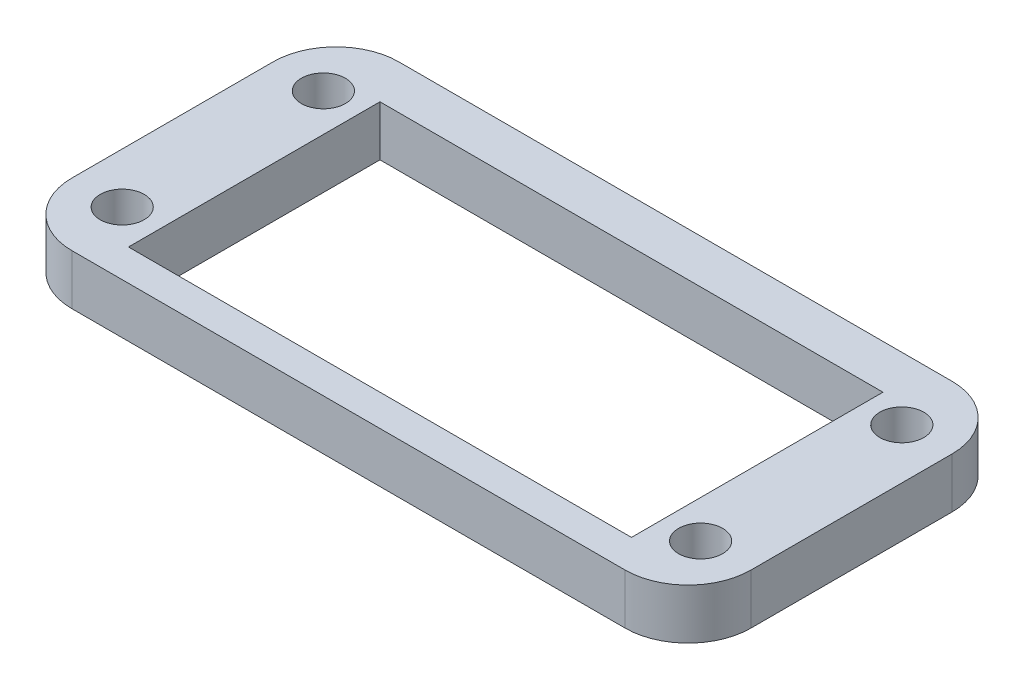
ISO-10303-21;
HEADER;
FILE_DESCRIPTION(('STEP AP214'),'2;1');
FILE_NAME('part.step','',(''),(''),'','','');
FILE_SCHEMA(('AUTOMOTIVE_DESIGN { 1 0 10303 214 1 1 1 1 }'));
ENDSEC;
DATA;
#1=APPLICATION_CONTEXT('core data for automotive mechanical design processes');
#2=APPLICATION_PROTOCOL_DEFINITION('international standard','automotive_design',2000,#1);
#3=PRODUCT_CONTEXT('',#1,'mechanical');
#4=PRODUCT('Part','Part','',(#3));
#5=PRODUCT_RELATED_PRODUCT_CATEGORY('part','',(#4));
#6=PRODUCT_DEFINITION_FORMATION('','',#4);
#7=PRODUCT_DEFINITION_CONTEXT('part definition',#1,'design');
#8=PRODUCT_DEFINITION('design','',#6,#7);
#9=PRODUCT_DEFINITION_SHAPE('','',#8);
#10=(LENGTH_UNIT() NAMED_UNIT(*) SI_UNIT(.MILLI.,.METRE.));
#11=(NAMED_UNIT(*) PLANE_ANGLE_UNIT() SI_UNIT($,.RADIAN.));
#12=(NAMED_UNIT(*) SI_UNIT($,.STERADIAN.) SOLID_ANGLE_UNIT());
#13=UNCERTAINTY_MEASURE_WITH_UNIT(LENGTH_MEASURE(1.E-05),#10,'distance_accuracy_value','');
#14=(GEOMETRIC_REPRESENTATION_CONTEXT(3) GLOBAL_UNCERTAINTY_ASSIGNED_CONTEXT((#13)) GLOBAL_UNIT_ASSIGNED_CONTEXT((#10,
#11,#12)) REPRESENTATION_CONTEXT('',''));
#15=CARTESIAN_POINT('',(0.,0.,0.));
#16=DIRECTION('',(0.,0.,1.));
#17=DIRECTION('',(1.,0.,0.));
#18=AXIS2_PLACEMENT_3D('',#15,#16,#17);
#19=CARTESIAN_POINT('',(22.,4.,-8.));
#20=DIRECTION('',(0.,-1.,0.));
#21=DIRECTION('',(0.,0.,-1.));
#22=AXIS2_PLACEMENT_3D('',#19,#20,#21);
#23=PLANE('',#22);
#24=CARTESIAN_POINT('',(22.,4.,-8.));
#25=DIRECTION('',(0.,1.,0.));
#26=DIRECTION('',(0.,0.,-1.));
#27=AXIS2_PLACEMENT_3D('',#24,#25,#26);
#28=CIRCLE('',#27,5.);
#29=CARTESIAN_POINT('',(27.,4.,-7.99999999999997));
#30=VERTEX_POINT('',#29);
#31=CARTESIAN_POINT('',(22.,4.,-13.));
#32=VERTEX_POINT('',#31);
#33=EDGE_CURVE('E182',#30,#32,#28,.T.);
#34=ORIENTED_EDGE('',*,*,#33,.T.);
#35=DIRECTION('',(-1.,0.,0.));
#36=VECTOR('',#35,1.);
#37=CARTESIAN_POINT('',(-22.,4.,-13.));
#38=LINE('',#37,#36);
#39=CARTESIAN_POINT('',(-22.,4.,-13.));
#40=VERTEX_POINT('',#39);
#41=EDGE_CURVE('E186',#32,#40,#38,.T.);
#42=ORIENTED_EDGE('',*,*,#41,.T.);
#43=CARTESIAN_POINT('',(-22.,4.,-8.));
#44=DIRECTION('',(0.,1.,0.));
#45=DIRECTION('',(0.,0.,1.));
#46=AXIS2_PLACEMENT_3D('',#43,#44,#45);
#47=CIRCLE('',#46,5.);
#48=CARTESIAN_POINT('',(-27.,4.,-7.99999999999997));
#49=VERTEX_POINT('',#48);
#50=EDGE_CURVE('E190',#40,#49,#47,.T.);
#51=ORIENTED_EDGE('',*,*,#50,.T.);
#52=DIRECTION('',(0.,0.,1.));
#53=VECTOR('',#52,1.);
#54=CARTESIAN_POINT('',(-27.,4.,-7.99999999999996));
#55=LINE('',#54,#53);
#56=CARTESIAN_POINT('',(-27.,4.,7.99999999999997));
#57=VERTEX_POINT('',#56);
#58=EDGE_CURVE('E193',#49,#57,#55,.T.);
#59=ORIENTED_EDGE('',*,*,#58,.T.);
#60=CARTESIAN_POINT('',(-22.,4.,8.));
#61=DIRECTION('',(0.,1.,0.));
#62=DIRECTION('',(0.,0.,1.));
#63=AXIS2_PLACEMENT_3D('',#60,#61,#62);
#64=CIRCLE('',#63,5.);
#65=CARTESIAN_POINT('',(-22.,4.,13.));
#66=VERTEX_POINT('',#65);
#67=EDGE_CURVE('E196',#57,#66,#64,.T.);
#68=ORIENTED_EDGE('',*,*,#67,.T.);
#69=DIRECTION('',(1.,0.,0.));
#70=VECTOR('',#69,1.);
#71=CARTESIAN_POINT('',(-22.,4.,13.));
#72=LINE('',#71,#70);
#73=CARTESIAN_POINT('',(22.,4.,13.));
#74=VERTEX_POINT('',#73);
#75=EDGE_CURVE('E199',#66,#74,#72,.T.);
#76=ORIENTED_EDGE('',*,*,#75,.T.);
#77=CARTESIAN_POINT('',(22.,4.,8.));
#78=DIRECTION('',(0.,1.,0.));
#79=DIRECTION('',(0.,0.,-1.));
#80=AXIS2_PLACEMENT_3D('',#77,#78,#79);
#81=CIRCLE('',#80,5.);
#82=CARTESIAN_POINT('',(27.,4.,7.99999999999996));
#83=VERTEX_POINT('',#82);
#84=EDGE_CURVE('E202',#74,#83,#81,.T.);
#85=ORIENTED_EDGE('',*,*,#84,.T.);
#86=DIRECTION('',(0.,0.,-1.));
#87=VECTOR('',#86,1.);
#88=CARTESIAN_POINT('',(27.,4.,-7.99999999999997));
#89=LINE('',#88,#87);
#90=EDGE_CURVE('E205',#83,#30,#89,.T.);
#91=ORIENTED_EDGE('',*,*,#90,.T.);
#92=EDGE_LOOP('',(#34,#42,#51,#59,#68,#76,#85,#91));
#93=FACE_BOUND('',#92,.T.);
#94=DIRECTION('',(0.,0.,1.));
#95=VECTOR('',#94,1.);
#96=CARTESIAN_POINT('',(-20.,4.,-9.5));
#97=LINE('',#96,#95);
#98=CARTESIAN_POINT('',(-20.,4.,-9.5));
#99=VERTEX_POINT('',#98);
#100=CARTESIAN_POINT('',(-20.,4.,10.5));
#101=VERTEX_POINT('',#100);
#102=EDGE_CURVE('E130',#99,#101,#97,.T.);
#103=ORIENTED_EDGE('',*,*,#102,.F.);
#104=DIRECTION('',(-1.,0.,0.));
#105=VECTOR('',#104,1.);
#106=CARTESIAN_POINT('',(-20.,4.,-9.5));
#107=LINE('',#106,#105);
#108=CARTESIAN_POINT('',(20.,4.,-9.5));
#109=VERTEX_POINT('',#108);
#110=EDGE_CURVE('E159',#109,#99,#107,.T.);
#111=ORIENTED_EDGE('',*,*,#110,.F.);
#112=DIRECTION('',(0.,0.,-1.));
#113=VECTOR('',#112,1.);
#114=CARTESIAN_POINT('',(20.,4.,-9.5));
#115=LINE('',#114,#113);
#116=CARTESIAN_POINT('',(20.,4.,10.5));
#117=VERTEX_POINT('',#116);
#118=EDGE_CURVE('E153',#117,#109,#115,.T.);
#119=ORIENTED_EDGE('',*,*,#118,.F.);
#120=DIRECTION('',(1.,0.,0.));
#121=VECTOR('',#120,1.);
#122=CARTESIAN_POINT('',(-20.,4.,10.5));
#123=LINE('',#122,#121);
#124=EDGE_CURVE('E139',#101,#117,#123,.T.);
#125=ORIENTED_EDGE('',*,*,#124,.F.);
#126=EDGE_LOOP('',(#103,#111,#119,#125));
#127=FACE_BOUND('',#126,.T.);
#128=CARTESIAN_POINT('',(-23.,4.,8.));
#129=DIRECTION('',(0.,1.,0.));
#130=DIRECTION('',(0.,0.,1.));
#131=AXIS2_PLACEMENT_3D('',#128,#129,#130);
#132=CIRCLE('',#131,1.75);
#133=CARTESIAN_POINT('',(-23.,4.,9.75));
#134=VERTEX_POINT('',#133);
#135=EDGE_CURVE('E167',#134,#134,#132,.T.);
#136=ORIENTED_EDGE('',*,*,#135,.F.);
#137=EDGE_LOOP('',(#136));
#138=FACE_BOUND('',#137,.T.);
#139=CARTESIAN_POINT('',(-23.,4.,-8.));
#140=DIRECTION('',(0.,1.,0.));
#141=DIRECTION('',(0.,0.,1.));
#142=AXIS2_PLACEMENT_3D('',#139,#140,#141);
#143=CIRCLE('',#142,1.75);
#144=CARTESIAN_POINT('',(-23.,4.,-6.25));
#145=VERTEX_POINT('',#144);
#146=EDGE_CURVE('E372',#145,#145,#143,.T.);
#147=ORIENTED_EDGE('',*,*,#146,.F.);
#148=EDGE_LOOP('',(#147));
#149=FACE_BOUND('',#148,.T.);
#150=CARTESIAN_POINT('',(23.,4.,-8.));
#151=DIRECTION('',(0.,1.,0.));
#152=DIRECTION('',(0.,0.,1.));
#153=AXIS2_PLACEMENT_3D('',#150,#151,#152);
#154=CIRCLE('',#153,1.75);
#155=CARTESIAN_POINT('',(23.,4.,-6.25));
#156=VERTEX_POINT('',#155);
#157=EDGE_CURVE('E364',#156,#156,#154,.T.);
#158=ORIENTED_EDGE('',*,*,#157,.F.);
#159=EDGE_LOOP('',(#158));
#160=FACE_BOUND('',#159,.T.);
#161=CARTESIAN_POINT('',(23.,4.,8.));
#162=DIRECTION('',(0.,1.,0.));
#163=DIRECTION('',(0.,0.,1.));
#164=AXIS2_PLACEMENT_3D('',#161,#162,#163);
#165=CIRCLE('',#164,1.75);
#166=CARTESIAN_POINT('',(23.,4.,9.75));
#167=VERTEX_POINT('',#166);
#168=EDGE_CURVE('E352',#167,#167,#165,.T.);
#169=ORIENTED_EDGE('',*,*,#168,.F.);
#170=EDGE_LOOP('',(#169));
#171=FACE_BOUND('',#170,.T.);
#172=ADVANCED_FACE('F40',(#93,#127,#138,#149,#160,#171),#23,.F.);
#173=CARTESIAN_POINT('',(22.,0.,-8.));
#174=DIRECTION('',(0.,-1.,0.));
#175=DIRECTION('',(0.,0.,-1.));
#176=AXIS2_PLACEMENT_3D('',#173,#174,#175);
#177=PLANE('',#176);
#178=CARTESIAN_POINT('',(23.,0.,-8.));
#179=DIRECTION('',(0.,1.,0.));
#180=DIRECTION('',(0.,0.,1.));
#181=AXIS2_PLACEMENT_3D('',#178,#179,#180);
#182=CIRCLE('',#181,1.75);
#183=CARTESIAN_POINT('',(23.,0.,-6.25));
#184=VERTEX_POINT('',#183);
#185=EDGE_CURVE('E361',#184,#184,#182,.T.);
#186=ORIENTED_EDGE('',*,*,#185,.T.);
#187=EDGE_LOOP('',(#186));
#188=FACE_BOUND('',#187,.T.);
#189=CARTESIAN_POINT('',(-23.,0.,8.));
#190=DIRECTION('',(0.,1.,0.));
#191=DIRECTION('',(0.,0.,1.));
#192=AXIS2_PLACEMENT_3D('',#189,#190,#191);
#193=CIRCLE('',#192,1.75);
#194=CARTESIAN_POINT('',(-23.,0.,9.75));
#195=VERTEX_POINT('',#194);
#196=EDGE_CURVE('E376',#195,#195,#193,.T.);
#197=ORIENTED_EDGE('',*,*,#196,.T.);
#198=EDGE_LOOP('',(#197));
#199=FACE_BOUND('',#198,.T.);
#200=CARTESIAN_POINT('',(22.,0.,-8.));
#201=DIRECTION('',(0.,1.,0.));
#202=DIRECTION('',(0.,0.,-1.));
#203=AXIS2_PLACEMENT_3D('',#200,#201,#202);
#204=CIRCLE('',#203,5.);
#205=CARTESIAN_POINT('',(27.,0.,-7.99999999999997));
#206=VERTEX_POINT('',#205);
#207=CARTESIAN_POINT('',(22.,0.,-13.));
#208=VERTEX_POINT('',#207);
#209=EDGE_CURVE('E148',#206,#208,#204,.T.);
#210=ORIENTED_EDGE('',*,*,#209,.F.);
#211=DIRECTION('',(0.,0.,-1.));
#212=VECTOR('',#211,1.);
#213=CARTESIAN_POINT('',(27.,0.,-7.99999999999997));
#214=LINE('',#213,#212);
#215=CARTESIAN_POINT('',(27.,0.,7.99999999999996));
#216=VERTEX_POINT('',#215);
#217=EDGE_CURVE('E187',#216,#206,#214,.T.);
#218=ORIENTED_EDGE('',*,*,#217,.F.);
#219=CARTESIAN_POINT('',(22.,0.,8.));
#220=DIRECTION('',(0.,1.,0.));
#221=DIRECTION('',(0.,0.,-1.));
#222=AXIS2_PLACEMENT_3D('',#219,#220,#221);
#223=CIRCLE('',#222,5.);
#224=CARTESIAN_POINT('',(22.,0.,13.));
#225=VERTEX_POINT('',#224);
#226=EDGE_CURVE('E227',#225,#216,#223,.T.);
#227=ORIENTED_EDGE('',*,*,#226,.F.);
#228=DIRECTION('',(1.,0.,0.));
#229=VECTOR('',#228,1.);
#230=CARTESIAN_POINT('',(-22.,0.,13.));
#231=LINE('',#230,#229);
#232=CARTESIAN_POINT('',(-22.,0.,13.));
#233=VERTEX_POINT('',#232);
#234=EDGE_CURVE('E224',#233,#225,#231,.T.);
#235=ORIENTED_EDGE('',*,*,#234,.F.);
#236=CARTESIAN_POINT('',(-22.,0.,8.));
#237=DIRECTION('',(0.,1.,0.));
#238=DIRECTION('',(0.,0.,1.));
#239=AXIS2_PLACEMENT_3D('',#236,#237,#238);
#240=CIRCLE('',#239,5.);
#241=CARTESIAN_POINT('',(-27.,0.,7.99999999999997));
#242=VERTEX_POINT('',#241);
#243=EDGE_CURVE('E221',#242,#233,#240,.T.);
#244=ORIENTED_EDGE('',*,*,#243,.F.);
#245=DIRECTION('',(0.,0.,1.));
#246=VECTOR('',#245,1.);
#247=CARTESIAN_POINT('',(-27.,0.,-7.99999999999996));
#248=LINE('',#247,#246);
#249=CARTESIAN_POINT('',(-27.,0.,-7.99999999999997));
#250=VERTEX_POINT('',#249);
#251=EDGE_CURVE('E218',#250,#242,#248,.T.);
#252=ORIENTED_EDGE('',*,*,#251,.F.);
#253=CARTESIAN_POINT('',(-22.,0.,-8.));
#254=DIRECTION('',(0.,1.,0.));
#255=DIRECTION('',(0.,0.,1.));
#256=AXIS2_PLACEMENT_3D('',#253,#254,#255);
#257=CIRCLE('',#256,5.);
#258=CARTESIAN_POINT('',(-22.,0.,-13.));
#259=VERTEX_POINT('',#258);
#260=EDGE_CURVE('E215',#259,#250,#257,.T.);
#261=ORIENTED_EDGE('',*,*,#260,.F.);
#262=DIRECTION('',(-1.,0.,0.));
#263=VECTOR('',#262,1.);
#264=CARTESIAN_POINT('',(-22.,0.,-13.));
#265=LINE('',#264,#263);
#266=EDGE_CURVE('E212',#208,#259,#265,.T.);
#267=ORIENTED_EDGE('',*,*,#266,.F.);
#268=EDGE_LOOP('',(#210,#218,#227,#235,#244,#252,#261,#267));
#269=FACE_BOUND('',#268,.T.);
#270=DIRECTION('',(-1.,0.,0.));
#271=VECTOR('',#270,1.);
#272=CARTESIAN_POINT('',(-20.,0.,-9.5));
#273=LINE('',#272,#271);
#274=CARTESIAN_POINT('',(20.,0.,-9.5));
#275=VERTEX_POINT('',#274);
#276=CARTESIAN_POINT('',(-20.,0.,-9.5));
#277=VERTEX_POINT('',#276);
#278=EDGE_CURVE('E140',#275,#277,#273,.T.);
#279=ORIENTED_EDGE('',*,*,#278,.T.);
#280=DIRECTION('',(0.,0.,1.));
#281=VECTOR('',#280,1.);
#282=CARTESIAN_POINT('',(-20.,0.,-9.5));
#283=LINE('',#282,#281);
#284=CARTESIAN_POINT('',(-20.,0.,10.5));
#285=VERTEX_POINT('',#284);
#286=EDGE_CURVE('E64',#277,#285,#283,.T.);
#287=ORIENTED_EDGE('',*,*,#286,.T.);
#288=DIRECTION('',(1.,0.,0.));
#289=VECTOR('',#288,1.);
#290=CARTESIAN_POINT('',(-20.,0.,10.5));
#291=LINE('',#290,#289);
#292=CARTESIAN_POINT('',(20.,0.,10.5));
#293=VERTEX_POINT('',#292);
#294=EDGE_CURVE('E146',#285,#293,#291,.T.);
#295=ORIENTED_EDGE('',*,*,#294,.T.);
#296=DIRECTION('',(0.,0.,-1.));
#297=VECTOR('',#296,1.);
#298=CARTESIAN_POINT('',(20.,0.,-9.5));
#299=LINE('',#298,#297);
#300=EDGE_CURVE('E170',#293,#275,#299,.T.);
#301=ORIENTED_EDGE('',*,*,#300,.T.);
#302=EDGE_LOOP('',(#279,#287,#295,#301));
#303=FACE_BOUND('',#302,.T.);
#304=CARTESIAN_POINT('',(-23.,0.,-8.));
#305=DIRECTION('',(0.,1.,0.));
#306=DIRECTION('',(0.,0.,1.));
#307=AXIS2_PLACEMENT_3D('',#304,#305,#306);
#308=CIRCLE('',#307,1.75);
#309=CARTESIAN_POINT('',(-23.,0.,-6.25));
#310=VERTEX_POINT('',#309);
#311=EDGE_CURVE('E368',#310,#310,#308,.T.);
#312=ORIENTED_EDGE('',*,*,#311,.T.);
#313=EDGE_LOOP('',(#312));
#314=FACE_BOUND('',#313,.T.);
#315=CARTESIAN_POINT('',(23.,0.,8.));
#316=DIRECTION('',(0.,1.,0.));
#317=DIRECTION('',(0.,0.,1.));
#318=AXIS2_PLACEMENT_3D('',#315,#316,#317);
#319=CIRCLE('',#318,1.75);
#320=CARTESIAN_POINT('',(23.,0.,9.75));
#321=VERTEX_POINT('',#320);
#322=EDGE_CURVE('E355',#321,#321,#319,.T.);
#323=ORIENTED_EDGE('',*,*,#322,.T.);
#324=EDGE_LOOP('',(#323));
#325=FACE_BOUND('',#324,.T.);
#326=ADVANCED_FACE('F266',(#188,#199,#269,#303,#314,#325),#177,.T.);
#327=CARTESIAN_POINT('',(22.,4.,-8.));
#328=DIRECTION('',(0.,-1.,0.));
#329=DIRECTION('',(0.,0.,-1.));
#330=AXIS2_PLACEMENT_3D('',#327,#328,#329);
#331=CYLINDRICAL_SURFACE('',#330,5.);
#332=ORIENTED_EDGE('',*,*,#209,.T.);
#333=DIRECTION('',(0.,-1.,0.));
#334=VECTOR('',#333,1.);
#335=CARTESIAN_POINT('',(22.,4.,-13.));
#336=LINE('',#335,#334);
#337=EDGE_CURVE('E11',#32,#208,#336,.T.);
#338=ORIENTED_EDGE('',*,*,#337,.F.);
#339=ORIENTED_EDGE('',*,*,#33,.F.);
#340=DIRECTION('',(0.,-1.,0.));
#341=VECTOR('',#340,1.);
#342=CARTESIAN_POINT('',(27.,4.,-7.99999999999997));
#343=LINE('',#342,#341);
#344=EDGE_CURVE('E208',#30,#206,#343,.T.);
#345=ORIENTED_EDGE('',*,*,#344,.T.);
#346=EDGE_LOOP('',(#332,#338,#339,#345));
#347=FACE_BOUND('',#346,.T.);
#348=ADVANCED_FACE('F42',(#347),#331,.T.);
#349=CARTESIAN_POINT('',(-22.,4.,-13.));
#350=DIRECTION('',(0.,0.,1.));
#351=DIRECTION('',(1.,0.,0.));
#352=AXIS2_PLACEMENT_3D('',#349,#350,#351);
#353=PLANE('',#352);
#354=ORIENTED_EDGE('',*,*,#266,.T.);
#355=DIRECTION('',(0.,-1.,0.));
#356=VECTOR('',#355,1.);
#357=CARTESIAN_POINT('',(-22.,4.,-13.));
#358=LINE('',#357,#356);
#359=EDGE_CURVE('E49',#40,#259,#358,.T.);
#360=ORIENTED_EDGE('',*,*,#359,.F.);
#361=ORIENTED_EDGE('',*,*,#41,.F.);
#362=ORIENTED_EDGE('',*,*,#337,.T.);
#363=EDGE_LOOP('',(#354,#360,#361,#362));
#364=FACE_BOUND('',#363,.T.);
#365=ADVANCED_FACE('F283',(#364),#353,.F.);
#366=CARTESIAN_POINT('',(-22.,4.,-8.));
#367=DIRECTION('',(0.,-1.,0.));
#368=DIRECTION('',(0.,0.,-1.));
#369=AXIS2_PLACEMENT_3D('',#366,#367,#368);
#370=CYLINDRICAL_SURFACE('',#369,5.);
#371=ORIENTED_EDGE('',*,*,#260,.T.);
#372=DIRECTION('',(0.,-1.,0.));
#373=VECTOR('',#372,1.);
#374=CARTESIAN_POINT('',(-27.,4.,-7.99999999999997));
#375=LINE('',#374,#373);
#376=EDGE_CURVE('E251',#49,#250,#375,.T.);
#377=ORIENTED_EDGE('',*,*,#376,.F.);
#378=ORIENTED_EDGE('',*,*,#50,.F.);
#379=ORIENTED_EDGE('',*,*,#359,.T.);
#380=EDGE_LOOP('',(#371,#377,#378,#379));
#381=FACE_BOUND('',#380,.T.);
#382=ADVANCED_FACE('F260',(#381),#370,.T.);
#383=CARTESIAN_POINT('',(-27.,4.,-7.99999999999996));
#384=DIRECTION('',(1.,0.,0.));
#385=DIRECTION('',(0.,0.,-1.));
#386=AXIS2_PLACEMENT_3D('',#383,#384,#385);
#387=PLANE('',#386);
#388=ORIENTED_EDGE('',*,*,#251,.T.);
#389=DIRECTION('',(0.,-1.,0.));
#390=VECTOR('',#389,1.);
#391=CARTESIAN_POINT('',(-27.,4.,7.99999999999997));
#392=LINE('',#391,#390);
#393=EDGE_CURVE('E247',#57,#242,#392,.T.);
#394=ORIENTED_EDGE('',*,*,#393,.F.);
#395=ORIENTED_EDGE('',*,*,#58,.F.);
#396=ORIENTED_EDGE('',*,*,#376,.T.);
#397=EDGE_LOOP('',(#388,#394,#395,#396));
#398=FACE_BOUND('',#397,.T.);
#399=ADVANCED_FACE('F272',(#398),#387,.F.);
#400=CARTESIAN_POINT('',(-22.,4.,8.));
#401=DIRECTION('',(0.,-1.,0.));
#402=DIRECTION('',(0.,0.,-1.));
#403=AXIS2_PLACEMENT_3D('',#400,#401,#402);
#404=CYLINDRICAL_SURFACE('',#403,5.);
#405=ORIENTED_EDGE('',*,*,#243,.T.);
#406=DIRECTION('',(0.,-1.,0.));
#407=VECTOR('',#406,1.);
#408=CARTESIAN_POINT('',(-22.,4.,13.));
#409=LINE('',#408,#407);
#410=EDGE_CURVE('E243',#66,#233,#409,.T.);
#411=ORIENTED_EDGE('',*,*,#410,.F.);
#412=ORIENTED_EDGE('',*,*,#67,.F.);
#413=ORIENTED_EDGE('',*,*,#393,.T.);
#414=EDGE_LOOP('',(#405,#411,#412,#413));
#415=FACE_BOUND('',#414,.T.);
#416=ADVANCED_FACE('F276',(#415),#404,.T.);
#417=CARTESIAN_POINT('',(-22.,4.,13.));
#418=DIRECTION('',(0.,0.,-1.));
#419=DIRECTION('',(-1.,0.,0.));
#420=AXIS2_PLACEMENT_3D('',#417,#418,#419);
#421=PLANE('',#420);
#422=ORIENTED_EDGE('',*,*,#234,.T.);
#423=DIRECTION('',(0.,-1.,0.));
#424=VECTOR('',#423,1.);
#425=CARTESIAN_POINT('',(22.,4.,13.));
#426=LINE('',#425,#424);
#427=EDGE_CURVE('E239',#74,#225,#426,.T.);
#428=ORIENTED_EDGE('',*,*,#427,.F.);
#429=ORIENTED_EDGE('',*,*,#75,.F.);
#430=ORIENTED_EDGE('',*,*,#410,.T.);
#431=EDGE_LOOP('',(#422,#428,#429,#430));
#432=FACE_BOUND('',#431,.T.);
#433=ADVANCED_FACE('F296',(#432),#421,.F.);
#434=CARTESIAN_POINT('',(22.,4.,8.));
#435=DIRECTION('',(0.,-1.,0.));
#436=DIRECTION('',(0.,0.,-1.));
#437=AXIS2_PLACEMENT_3D('',#434,#435,#436);
#438=CYLINDRICAL_SURFACE('',#437,5.);
#439=ORIENTED_EDGE('',*,*,#226,.T.);
#440=DIRECTION('',(0.,-1.,0.));
#441=VECTOR('',#440,1.);
#442=CARTESIAN_POINT('',(27.,4.,7.99999999999996));
#443=LINE('',#442,#441);
#444=EDGE_CURVE('E235',#83,#216,#443,.T.);
#445=ORIENTED_EDGE('',*,*,#444,.F.);
#446=ORIENTED_EDGE('',*,*,#84,.F.);
#447=ORIENTED_EDGE('',*,*,#427,.T.);
#448=EDGE_LOOP('',(#439,#445,#446,#447));
#449=FACE_BOUND('',#448,.T.);
#450=ADVANCED_FACE('F294',(#449),#438,.T.);
#451=CARTESIAN_POINT('',(27.,4.,-7.99999999999997));
#452=DIRECTION('',(-1.,0.,0.));
#453=DIRECTION('',(0.,0.,1.));
#454=AXIS2_PLACEMENT_3D('',#451,#452,#453);
#455=PLANE('',#454);
#456=ORIENTED_EDGE('',*,*,#217,.T.);
#457=ORIENTED_EDGE('',*,*,#344,.F.);
#458=ORIENTED_EDGE('',*,*,#90,.F.);
#459=ORIENTED_EDGE('',*,*,#444,.T.);
#460=EDGE_LOOP('',(#456,#457,#458,#459));
#461=FACE_BOUND('',#460,.T.);
#462=ADVANCED_FACE('F289',(#461),#455,.F.);
#463=CARTESIAN_POINT('',(-20.,4.,-9.5));
#464=DIRECTION('',(1.,0.,0.));
#465=DIRECTION('',(0.,0.,-1.));
#466=AXIS2_PLACEMENT_3D('',#463,#464,#465);
#467=PLANE('',#466);
#468=ORIENTED_EDGE('',*,*,#286,.F.);
#469=DIRECTION('',(0.,-1.,0.));
#470=VECTOR('',#469,1.);
#471=CARTESIAN_POINT('',(-20.,4.,-9.5));
#472=LINE('',#471,#470);
#473=EDGE_CURVE('E134',#99,#277,#472,.T.);
#474=ORIENTED_EDGE('',*,*,#473,.F.);
#475=ORIENTED_EDGE('',*,*,#102,.T.);
#476=DIRECTION('',(0.,-1.,0.));
#477=VECTOR('',#476,1.);
#478=CARTESIAN_POINT('',(-20.,4.,10.5));
#479=LINE('',#478,#477);
#480=EDGE_CURVE('E133',#101,#285,#479,.T.);
#481=ORIENTED_EDGE('',*,*,#480,.T.);
#482=EDGE_LOOP('',(#468,#474,#475,#481));
#483=FACE_BOUND('',#482,.T.);
#484=ADVANCED_FACE('F132',(#483),#467,.T.);
#485=CARTESIAN_POINT('',(-20.,4.,10.5));
#486=DIRECTION('',(0.,0.,-1.));
#487=DIRECTION('',(-1.,0.,0.));
#488=AXIS2_PLACEMENT_3D('',#485,#486,#487);
#489=PLANE('',#488);
#490=ORIENTED_EDGE('',*,*,#294,.F.);
#491=ORIENTED_EDGE('',*,*,#480,.F.);
#492=ORIENTED_EDGE('',*,*,#124,.T.);
#493=DIRECTION('',(0.,-1.,0.));
#494=VECTOR('',#493,1.);
#495=CARTESIAN_POINT('',(20.,4.,10.5));
#496=LINE('',#495,#494);
#497=EDGE_CURVE('E149',#117,#293,#496,.T.);
#498=ORIENTED_EDGE('',*,*,#497,.T.);
#499=EDGE_LOOP('',(#490,#491,#492,#498));
#500=FACE_BOUND('',#499,.T.);
#501=ADVANCED_FACE('F143',(#500),#489,.T.);
#502=CARTESIAN_POINT('',(20.,4.,-9.5));
#503=DIRECTION('',(-1.,0.,0.));
#504=DIRECTION('',(0.,0.,1.));
#505=AXIS2_PLACEMENT_3D('',#502,#503,#504);
#506=PLANE('',#505);
#507=ORIENTED_EDGE('',*,*,#300,.F.);
#508=ORIENTED_EDGE('',*,*,#497,.F.);
#509=ORIENTED_EDGE('',*,*,#118,.T.);
#510=DIRECTION('',(0.,-1.,0.));
#511=VECTOR('',#510,1.);
#512=CARTESIAN_POINT('',(20.,4.,-9.5));
#513=LINE('',#512,#511);
#514=EDGE_CURVE('E56',#109,#275,#513,.T.);
#515=ORIENTED_EDGE('',*,*,#514,.T.);
#516=EDGE_LOOP('',(#507,#508,#509,#515));
#517=FACE_BOUND('',#516,.T.);
#518=ADVANCED_FACE('F322',(#517),#506,.T.);
#519=CARTESIAN_POINT('',(-20.,4.,-9.5));
#520=DIRECTION('',(0.,0.,1.));
#521=DIRECTION('',(1.,0.,0.));
#522=AXIS2_PLACEMENT_3D('',#519,#520,#521);
#523=PLANE('',#522);
#524=ORIENTED_EDGE('',*,*,#278,.F.);
#525=ORIENTED_EDGE('',*,*,#514,.F.);
#526=ORIENTED_EDGE('',*,*,#110,.T.);
#527=ORIENTED_EDGE('',*,*,#473,.T.);
#528=EDGE_LOOP('',(#524,#525,#526,#527));
#529=FACE_BOUND('',#528,.T.);
#530=ADVANCED_FACE('F326',(#529),#523,.T.);
#531=CARTESIAN_POINT('',(-23.,4.,8.));
#532=DIRECTION('',(0.,-1.,0.));
#533=DIRECTION('',(0.,0.,-1.));
#534=AXIS2_PLACEMENT_3D('',#531,#532,#533);
#535=CYLINDRICAL_SURFACE('',#534,1.75);
#536=ORIENTED_EDGE('',*,*,#135,.T.);
#537=EDGE_LOOP('',(#536));
#538=FACE_BOUND('',#537,.T.);
#539=ORIENTED_EDGE('',*,*,#196,.F.);
#540=EDGE_LOOP('',(#539));
#541=FACE_BOUND('',#540,.T.);
#542=ADVANCED_FACE('F332',(#538,#541),#535,.F.);
#543=CARTESIAN_POINT('',(-23.,4.,-8.));
#544=DIRECTION('',(0.,-1.,0.));
#545=DIRECTION('',(0.,0.,-1.));
#546=AXIS2_PLACEMENT_3D('',#543,#544,#545);
#547=CYLINDRICAL_SURFACE('',#546,1.75);
#548=ORIENTED_EDGE('',*,*,#146,.T.);
#549=EDGE_LOOP('',(#548));
#550=FACE_BOUND('',#549,.T.);
#551=ORIENTED_EDGE('',*,*,#311,.F.);
#552=EDGE_LOOP('',(#551));
#553=FACE_BOUND('',#552,.T.);
#554=ADVANCED_FACE('F335',(#550,#553),#547,.F.);
#555=CARTESIAN_POINT('',(23.,4.,-8.));
#556=DIRECTION('',(0.,-1.,0.));
#557=DIRECTION('',(0.,0.,-1.));
#558=AXIS2_PLACEMENT_3D('',#555,#556,#557);
#559=CYLINDRICAL_SURFACE('',#558,1.75);
#560=ORIENTED_EDGE('',*,*,#157,.T.);
#561=EDGE_LOOP('',(#560));
#562=FACE_BOUND('',#561,.T.);
#563=ORIENTED_EDGE('',*,*,#185,.F.);
#564=EDGE_LOOP('',(#563));
#565=FACE_BOUND('',#564,.T.);
#566=ADVANCED_FACE('F339',(#562,#565),#559,.F.);
#567=CARTESIAN_POINT('',(23.,4.,8.));
#568=DIRECTION('',(0.,-1.,0.));
#569=DIRECTION('',(0.,0.,-1.));
#570=AXIS2_PLACEMENT_3D('',#567,#568,#569);
#571=CYLINDRICAL_SURFACE('',#570,1.75);
#572=ORIENTED_EDGE('',*,*,#168,.T.);
#573=EDGE_LOOP('',(#572));
#574=FACE_BOUND('',#573,.T.);
#575=ORIENTED_EDGE('',*,*,#322,.F.);
#576=EDGE_LOOP('',(#575));
#577=FACE_BOUND('',#576,.T.);
#578=ADVANCED_FACE('F343',(#574,#577),#571,.F.);
#579=CLOSED_SHELL('',(#172,#326,#348,#365,#382,#399,#416,#433,#450,#462,#484,#501,#518,#530,
#542,#554,#566,#578));
#580=MANIFOLD_SOLID_BREP('B2',#579);
#581=ADVANCED_BREP_SHAPE_REPRESENTATION('',(#18,#580),#14);
#582=SHAPE_DEFINITION_REPRESENTATION(#9,#581);
ENDSEC;
END-ISO-10303-21;
